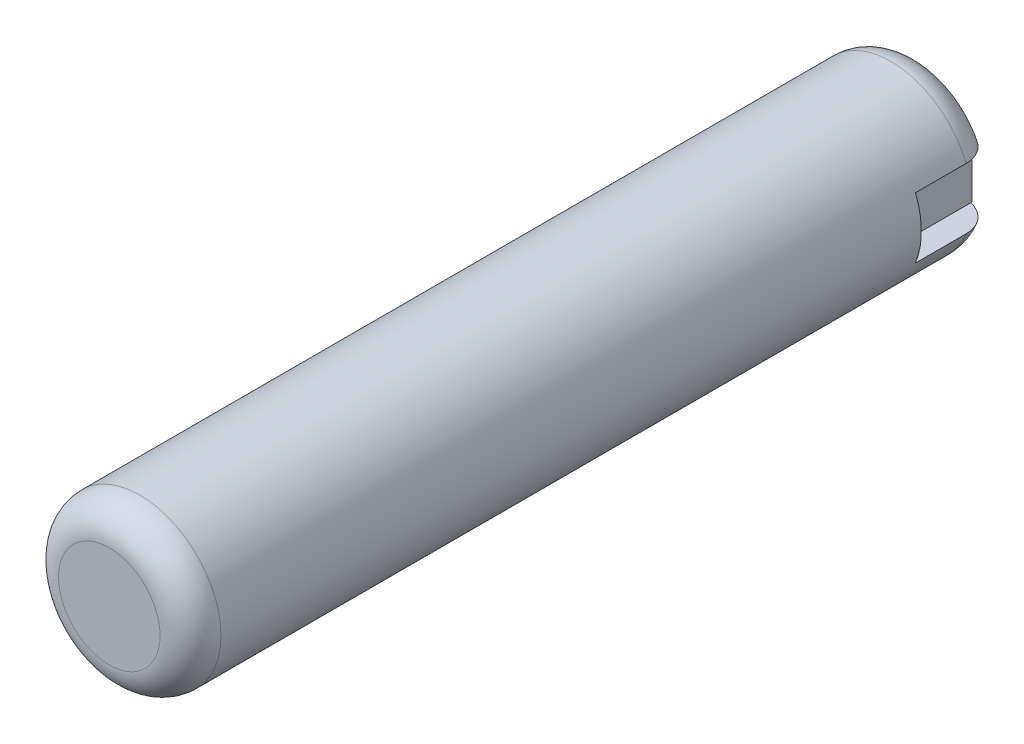
ISO-10303-21;
HEADER;
FILE_DESCRIPTION(('STEP AP214'),'2;1');
FILE_NAME('part.step','',(''),(''),'','','');
FILE_SCHEMA(('AUTOMOTIVE_DESIGN { 1 0 10303 214 1 1 1 1 }'));
ENDSEC;
DATA;
#1=APPLICATION_CONTEXT('core data for automotive mechanical design processes');
#2=APPLICATION_PROTOCOL_DEFINITION('international standard','automotive_design',2000,#1);
#3=PRODUCT_CONTEXT('',#1,'mechanical');
#4=PRODUCT('Part','Part','',(#3));
#5=PRODUCT_RELATED_PRODUCT_CATEGORY('part','',(#4));
#6=PRODUCT_DEFINITION_FORMATION('','',#4);
#7=PRODUCT_DEFINITION_CONTEXT('part definition',#1,'design');
#8=PRODUCT_DEFINITION('design','',#6,#7);
#9=PRODUCT_DEFINITION_SHAPE('','',#8);
#10=(LENGTH_UNIT() NAMED_UNIT(*) SI_UNIT(.MILLI.,.METRE.));
#11=(NAMED_UNIT(*) PLANE_ANGLE_UNIT() SI_UNIT($,.RADIAN.));
#12=(NAMED_UNIT(*) SI_UNIT($,.STERADIAN.) SOLID_ANGLE_UNIT());
#13=UNCERTAINTY_MEASURE_WITH_UNIT(LENGTH_MEASURE(1.E-05),#10,'distance_accuracy_value','');
#14=(GEOMETRIC_REPRESENTATION_CONTEXT(3) GLOBAL_UNCERTAINTY_ASSIGNED_CONTEXT((#13)) GLOBAL_UNIT_ASSIGNED_CONTEXT((#10,
#11,#12)) REPRESENTATION_CONTEXT('',''));
#15=CARTESIAN_POINT('',(0.,0.,0.));
#16=DIRECTION('',(0.,0.,1.));
#17=DIRECTION('',(1.,0.,0.));
#18=AXIS2_PLACEMENT_3D('',#15,#16,#17);
#19=CARTESIAN_POINT('',(0.,0.,-16.));
#20=DIRECTION('',(0.,0.,-1.));
#21=DIRECTION('',(-1.,0.,0.));
#22=AXIS2_PLACEMENT_3D('',#19,#20,#21);
#23=PLANE('',#22);
#24=DIRECTION('',(0.,-1.,0.));
#25=VECTOR('',#24,1.);
#26=CARTESIAN_POINT('',(2.5,1.5,-16.));
#27=LINE('',#26,#25);
#28=CARTESIAN_POINT('',(2.5,1.5,-16.));
#29=VERTEX_POINT('',#28);
#30=CARTESIAN_POINT('',(2.5,-1.5,-16.));
#31=VERTEX_POINT('',#30);
#32=EDGE_CURVE('E93',#29,#31,#27,.T.);
#33=ORIENTED_EDGE('',*,*,#32,.F.);
#34=DIRECTION('',(1.,0.,0.));
#35=VECTOR('',#34,1.);
#36=CARTESIAN_POINT('',(2.5,1.5,-16.));
#37=LINE('',#36,#35);
#38=CARTESIAN_POINT('',(-2.5,1.5,-16.));
#39=VERTEX_POINT('',#38);
#40=EDGE_CURVE('E104',#39,#29,#37,.T.);
#41=ORIENTED_EDGE('',*,*,#40,.F.);
#42=DIRECTION('',(0.,1.,0.));
#43=VECTOR('',#42,1.);
#44=CARTESIAN_POINT('',(-2.5,1.5,-16.));
#45=LINE('',#44,#43);
#46=CARTESIAN_POINT('',(-2.5,-1.5,-16.));
#47=VERTEX_POINT('',#46);
#48=EDGE_CURVE('E95',#47,#39,#45,.T.);
#49=ORIENTED_EDGE('',*,*,#48,.F.);
#50=DIRECTION('',(-1.,0.,0.));
#51=VECTOR('',#50,1.);
#52=CARTESIAN_POINT('',(2.5,-1.5,-16.));
#53=LINE('',#52,#51);
#54=EDGE_CURVE('E85',#31,#47,#53,.T.);
#55=ORIENTED_EDGE('',*,*,#54,.F.);
#56=EDGE_LOOP('',(#33,#41,#49,#55));
#57=FACE_BOUND('',#56,.T.);
#58=ADVANCED_FACE('F43',(#57),#23,.F.);
#59=CARTESIAN_POINT('',(2.5,1.5,-25.8309518948453));
#60=DIRECTION('',(0.,-1.,0.));
#61=DIRECTION('',(0.,0.,-1.));
#62=AXIS2_PLACEMENT_3D('',#59,#60,#61);
#63=PLANE('',#62);
#64=DIRECTION('',(0.,0.,1.));
#65=VECTOR('',#64,1.);
#66=CARTESIAN_POINT('',(2.5,1.5,-25.8309518948453));
#67=LINE('',#66,#65);
#68=CARTESIAN_POINT('',(2.5,1.5,-20.));
#69=VERTEX_POINT('',#68);
#70=EDGE_CURVE('E98',#69,#29,#67,.T.);
#71=ORIENTED_EDGE('',*,*,#70,.F.);
#72=DIRECTION('',(-1.,0.,0.));
#73=VECTOR('',#72,1.);
#74=CARTESIAN_POINT('',(2.5,1.5,-20.));
#75=LINE('',#74,#73);
#76=CARTESIAN_POINT('',(-2.5,1.5,-20.));
#77=VERTEX_POINT('',#76);
#78=EDGE_CURVE('E47',#69,#77,#75,.T.);
#79=ORIENTED_EDGE('',*,*,#78,.T.);
#80=DIRECTION('',(0.,0.,1.));
#81=VECTOR('',#80,1.);
#82=CARTESIAN_POINT('',(-2.5,1.5,-25.8309518948453));
#83=LINE('',#82,#81);
#84=EDGE_CURVE('E107',#77,#39,#83,.T.);
#85=ORIENTED_EDGE('',*,*,#84,.T.);
#86=ORIENTED_EDGE('',*,*,#40,.T.);
#87=EDGE_LOOP('',(#71,#79,#85,#86));
#88=FACE_BOUND('',#87,.T.);
#89=ADVANCED_FACE('F116',(#88),#63,.F.);
#90=CARTESIAN_POINT('',(-2.5,1.5,-25.8309518948453));
#91=DIRECTION('',(1.,0.,0.));
#92=DIRECTION('',(0.,0.,-1.));
#93=AXIS2_PLACEMENT_3D('',#90,#91,#92);
#94=PLANE('',#93);
#95=ORIENTED_EDGE('',*,*,#84,.F.);
#96=DIRECTION('',(0.,-1.,0.));
#97=VECTOR('',#96,1.);
#98=CARTESIAN_POINT('',(-2.5,1.5,-20.));
#99=LINE('',#98,#97);
#100=CARTESIAN_POINT('',(-2.5,-1.5,-20.));
#101=VERTEX_POINT('',#100);
#102=EDGE_CURVE('E113',#77,#101,#99,.T.);
#103=ORIENTED_EDGE('',*,*,#102,.T.);
#104=DIRECTION('',(0.,0.,1.));
#105=VECTOR('',#104,1.);
#106=CARTESIAN_POINT('',(-2.5,-1.5,-25.8309518948453));
#107=LINE('',#106,#105);
#108=EDGE_CURVE('E89',#101,#47,#107,.T.);
#109=ORIENTED_EDGE('',*,*,#108,.T.);
#110=ORIENTED_EDGE('',*,*,#48,.T.);
#111=EDGE_LOOP('',(#95,#103,#109,#110));
#112=FACE_BOUND('',#111,.T.);
#113=ADVANCED_FACE('F112',(#112),#94,.F.);
#114=CARTESIAN_POINT('',(2.5,-1.5,-25.8309518948453));
#115=DIRECTION('',(0.,1.,0.));
#116=DIRECTION('',(0.,0.,1.));
#117=AXIS2_PLACEMENT_3D('',#114,#115,#116);
#118=PLANE('',#117);
#119=ORIENTED_EDGE('',*,*,#108,.F.);
#120=DIRECTION('',(1.,0.,0.));
#121=VECTOR('',#120,1.);
#122=CARTESIAN_POINT('',(2.5,-1.5,-20.));
#123=LINE('',#122,#121);
#124=CARTESIAN_POINT('',(2.5,-1.5,-20.));
#125=VERTEX_POINT('',#124);
#126=EDGE_CURVE('E52',#101,#125,#123,.T.);
#127=ORIENTED_EDGE('',*,*,#126,.T.);
#128=DIRECTION('',(0.,0.,1.));
#129=VECTOR('',#128,1.);
#130=CARTESIAN_POINT('',(2.5,-1.5,-25.8309518948453));
#131=LINE('',#130,#129);
#132=EDGE_CURVE('E82',#125,#31,#131,.T.);
#133=ORIENTED_EDGE('',*,*,#132,.T.);
#134=ORIENTED_EDGE('',*,*,#54,.T.);
#135=EDGE_LOOP('',(#119,#127,#133,#134));
#136=FACE_BOUND('',#135,.T.);
#137=ADVANCED_FACE('F84',(#136),#118,.F.);
#138=CARTESIAN_POINT('',(2.5,1.5,-25.8309518948453));
#139=DIRECTION('',(-1.,0.,0.));
#140=DIRECTION('',(0.,-1.,0.));
#141=AXIS2_PLACEMENT_3D('',#138,#139,#140);
#142=PLANE('',#141);
#143=ORIENTED_EDGE('',*,*,#132,.F.);
#144=DIRECTION('',(0.,1.,0.));
#145=VECTOR('',#144,1.);
#146=CARTESIAN_POINT('',(2.5,1.5,-20.));
#147=LINE('',#146,#145);
#148=EDGE_CURVE('E12',#125,#69,#147,.T.);
#149=ORIENTED_EDGE('',*,*,#148,.T.);
#150=ORIENTED_EDGE('',*,*,#70,.T.);
#151=ORIENTED_EDGE('',*,*,#32,.T.);
#152=EDGE_LOOP('',(#143,#149,#150,#151));
#153=FACE_BOUND('',#152,.T.);
#154=ADVANCED_FACE('F45',(#153),#142,.F.);
#155=CARTESIAN_POINT('',(0.,0.,-20.));
#156=DIRECTION('',(0.,0.,1.));
#157=DIRECTION('',(1.,0.,0.));
#158=AXIS2_PLACEMENT_3D('',#155,#156,#157);
#159=PLANE('',#158);
#160=ORIENTED_EDGE('',*,*,#126,.F.);
#161=ORIENTED_EDGE('',*,*,#102,.F.);
#162=ORIENTED_EDGE('',*,*,#78,.F.);
#163=ORIENTED_EDGE('',*,*,#148,.F.);
#164=EDGE_LOOP('',(#160,#161,#162,#163));
#165=FACE_BOUND('',#164,.T.);
#166=ADVANCED_FACE('F130',(#165),#159,.F.);
#167=CLOSED_SHELL('',(#58,#89,#113,#137,#154,#166));
#168=MANIFOLD_SOLID_BREP('B2',#167);
#169=CARTESIAN_POINT('',(0.,0.,-20.));
#170=DIRECTION('',(0.,0.,1.));
#171=DIRECTION('',(1.,0.,0.));
#172=AXIS2_PLACEMENT_3D('',#169,#170,#171);
#173=PLANE('',#172);
#174=CARTESIAN_POINT('',(0.,0.,-20.));
#175=DIRECTION('',(0.,0.,1.));
#176=DIRECTION('',(1.,0.,0.));
#177=AXIS2_PLACEMENT_3D('',#174,#175,#176);
#178=CIRCLE('',#177,2.5);
#179=CARTESIAN_POINT('',(2.,-1.5,-20.));
#180=VERTEX_POINT('',#179);
#181=CARTESIAN_POINT('',(-1.99999999999999,-1.5,-20.));
#182=VERTEX_POINT('',#181);
#183=EDGE_CURVE('E236',#180,#182,#178,.F.);
#184=ORIENTED_EDGE('',*,*,#183,.T.);
#185=DIRECTION('',(1.,0.,0.));
#186=VECTOR('',#185,1.);
#187=CARTESIAN_POINT('',(-5.,-1.5,-20.));
#188=LINE('',#187,#186);
#189=EDGE_CURVE('E282',#182,#180,#188,.T.);
#190=ORIENTED_EDGE('',*,*,#189,.T.);
#191=EDGE_LOOP('',(#184,#190));
#192=FACE_BOUND('',#191,.T.);
#193=ADVANCED_FACE('F166',(#192),#173,.F.);
#194=CARTESIAN_POINT('',(0.,0.,-18.5));
#195=DIRECTION('',(0.,0.,1.));
#196=DIRECTION('',(1.,0.,0.));
#197=AXIS2_PLACEMENT_3D('',#194,#195,#196);
#198=TOROIDAL_SURFACE('',#197,2.5,1.5);
#199=CARTESIAN_POINT('',(0.,-1.5,-19.6180339887505));
#200=CARTESIAN_POINT('',(-0.067443218359986,-1.5,-19.6180389023118));
#201=CARTESIAN_POINT('',(-0.134891214664913,-1.5,-19.622194788994));
#202=CARTESIAN_POINT('',(-0.269113503832246,-1.5,-19.6378031521689));
#203=CARTESIAN_POINT('',(-0.335884506737289,-1.5,-19.6492817829432));
#204=CARTESIAN_POINT('',(-0.469702157328218,-1.5,-19.6774798642178));
#205=CARTESIAN_POINT('',(-0.536725433197593,-1.5,-19.6943037705338));
#206=CARTESIAN_POINT('',(-0.669981653953298,-1.5,-19.7305294834033));
#207=CARTESIAN_POINT('',(-0.736215176381459,-1.5,-19.7499292618913));
#208=CARTESIAN_POINT('',(-0.887458542690038,-1.5,-19.7948115372455));
#209=CARTESIAN_POINT('',(-0.972421877741422,-1.5,-19.8204471560161));
#210=CARTESIAN_POINT('',(-1.14314540221406,-1.5,-19.8690762139822));
#211=CARTESIAN_POINT('',(-1.22890570078372,-1.5,-19.8920692853262));
#212=CARTESIAN_POINT('',(-1.40069061196947,-1.5,-19.9325638404054));
#213=CARTESIAN_POINT('',(-1.48670001575131,-1.5,-19.9501272439693));
#214=CARTESIAN_POINT('',(-1.65986180086239,-1.5,-19.9780561528693));
#215=CARTESIAN_POINT('',(-1.74701344625855,-1.5,-19.9884260809764));
#216=CARTESIAN_POINT('',(-1.94596765287344,-1.5,-20.0018483978144));
#217=CARTESIAN_POINT('',(-2.05799071916539,-1.5,-20.0021224023447));
#218=CARTESIAN_POINT('',(-2.28124658847306,-1.5,-19.9852175644564));
#219=CARTESIAN_POINT('',(-2.39247516164495,-1.5,-19.9679766219299));
#220=CARTESIAN_POINT('',(-2.61120058918486,-1.5,-19.9137365826692));
#221=CARTESIAN_POINT('',(-2.71865555781505,-1.5,-19.8765634707244));
#222=CARTESIAN_POINT('',(-2.92401702575213,-1.5,-19.7816755911863));
#223=CARTESIAN_POINT('',(-3.0219412509115,-1.5,-19.7239999228368));
#224=CARTESIAN_POINT('',(-3.19032422177093,-1.5,-19.5987398165864));
#225=CARTESIAN_POINT('',(-3.26270827387416,-1.5,-19.5337414943054));
#226=CARTESIAN_POINT('',(-3.39363829174985,-1.5,-19.3910075327643));
#227=CARTESIAN_POINT('',(-3.45219226507034,-1.5,-19.3132793084239));
#228=CARTESIAN_POINT('',(-3.5464620418693,-1.5,-19.1578881198251));
#229=CARTESIAN_POINT('',(-3.58409723058932,-1.5,-19.0813844311611));
#230=CARTESIAN_POINT('',(-3.64505238801619,-1.5,-18.922881222557));
#231=CARTESIAN_POINT('',(-3.66837988574422,-1.5,-18.8408846183519));
#232=CARTESIAN_POINT('',(-3.69883241569647,-1.5,-18.6790248469315));
#233=CARTESIAN_POINT('',(-3.70684237749878,-1.5,-18.5993270043688));
#234=CARTESIAN_POINT('',(-3.7090816765802,-1.5,-18.4397417893482));
#235=CARTESIAN_POINT('',(-3.70331306457525,-1.5,-18.3598544468622));
#236=CARTESIAN_POINT('',(-3.67845493266942,-1.5,-18.2037639384382));
#237=CARTESIAN_POINT('',(-3.65962296399182,-1.5,-18.1275195013601));
#238=CARTESIAN_POINT('',(-3.60958299760921,-1.5,-17.9792171411024));
#239=CARTESIAN_POINT('',(-3.57837502848104,-1.5,-17.9071592082564));
#240=CARTESIAN_POINT('',(-3.50417305903596,-1.5,-17.768201729966));
#241=CARTESIAN_POINT('',(-3.46103169439424,-1.5,-17.7013810500179));
#242=CARTESIAN_POINT('',(-3.36458974499622,-1.5,-17.5755416136847));
#243=CARTESIAN_POINT('',(-3.31128753031318,-1.5,-17.5165241116022));
#244=CARTESIAN_POINT('',(-3.19360012134622,-1.5,-17.4050306746391));
#245=CARTESIAN_POINT('',(-3.12882472403076,-1.5,-17.3529675019128));
#246=CARTESIAN_POINT('',(-2.99202764598746,-1.5,-17.2595055940013));
#247=CARTESIAN_POINT('',(-2.9200051430539,-1.5,-17.2181080707671));
#248=CARTESIAN_POINT('',(-2.76452070601886,-1.5,-17.143323237907));
#249=CARTESIAN_POINT('',(-2.68060536202213,-1.5,-17.1108829963544));
#250=CARTESIAN_POINT('',(-2.50888581689852,-1.5,-17.0586572350327));
#251=CARTESIAN_POINT('',(-2.42107790327944,-1.5,-17.0388840866017));
#252=CARTESIAN_POINT('',(-2.26794192513112,-1.5,-17.0150304282208));
#253=CARTESIAN_POINT('',(-2.20302623381469,-1.5,-17.0081385147953));
#254=CARTESIAN_POINT('',(-2.0728187465825,-1.5,-17.0001834197843));
#255=CARTESIAN_POINT('',(-2.0075268147217,-1.5,-16.9991224970079));
#256=CARTESIAN_POINT('',(-1.87716387430802,-1.5,-17.002281141673));
#257=CARTESIAN_POINT('',(-1.81209269907248,-1.5,-17.0064947138274));
#258=CARTESIAN_POINT('',(-1.68241124854157,-1.5,-17.0195434177241));
#259=CARTESIAN_POINT('',(-1.61780111520115,-1.5,-17.0283799154812));
#260=CARTESIAN_POINT('',(-1.48722173464179,-1.5,-17.0502757621363));
#261=CARTESIAN_POINT('',(-1.42127381210264,-1.5,-17.0634593998186));
#262=CARTESIAN_POINT('',(-1.29011482422925,-1.5,-17.0930360074684));
#263=CARTESIAN_POINT('',(-1.22490379809051,-1.5,-17.1094291473072));
#264=CARTESIAN_POINT('',(-1.09462375239087,-1.5,-17.1444760339784));
#265=CARTESIAN_POINT('',(-1.02955880708644,-1.5,-17.1631445784241));
#266=CARTESIAN_POINT('',(-0.899683492892818,-1.5,-17.2013473018588));
#267=CARTESIAN_POINT('',(-0.834873151045946,-1.5,-17.2208815702303));
#268=CARTESIAN_POINT('',(-0.704302786086257,-1.5,-17.2594006129253));
#269=CARTESIAN_POINT('',(-0.638540185118781,-1.5,-17.2783769248361));
#270=CARTESIAN_POINT('',(-0.50619206538531,-1.5,-17.3134249456873));
#271=CARTESIAN_POINT('',(-0.439606365251178,-1.5,-17.3294960018172));
#272=CARTESIAN_POINT('',(-0.306399823396888,-1.5,-17.3559621846303));
#273=CARTESIAN_POINT('',(-0.239797959251787,-1.5,-17.3664472081624));
#274=CARTESIAN_POINT('',(-0.105897322625608,-1.5,-17.3798861769023));
#275=CARTESIAN_POINT('',(-0.0386001153917617,-1.5,-17.3828543987382));
#276=CARTESIAN_POINT('',(0.0710202725195837,-1.5,-17.381007535528));
#277=CARTESIAN_POINT('',(0.113400159589978,-1.5,-17.3786593044328));
#278=CARTESIAN_POINT('',(0.197892956878934,-1.5,-17.3709696449963));
#279=CARTESIAN_POINT('',(0.240005805238093,-1.5,-17.3656275470277));
#280=CARTESIAN_POINT('',(0.365954446881726,-1.5,-17.3457711252637));
#281=CARTESIAN_POINT('',(0.449168774898607,-1.5,-17.3274350239503));
#282=CARTESIAN_POINT('',(0.615981566159804,-1.5,-17.2850448311915));
#283=CARTESIAN_POINT('',(0.699546349630877,-1.5,-17.2608710833537));
#284=CARTESIAN_POINT('',(0.866270358430299,-1.5,-17.2115412072055));
#285=CARTESIAN_POINT('',(0.949429949398501,-1.5,-17.1863862890314));
#286=CARTESIAN_POINT('',(1.11499313591273,-1.5,-17.1387360563503));
#287=CARTESIAN_POINT('',(1.19738532389999,-1.5,-17.1162026023356));
#288=CARTESIAN_POINT('',(1.36335166827282,-1.5,-17.0756907211771));
#289=CARTESIAN_POINT('',(1.44692620721484,-1.5,-17.0577138056423));
#290=CARTESIAN_POINT('',(1.61428262207525,-1.5,-17.0284562579554));
#291=CARTESIAN_POINT('',(1.69805074073002,-1.5,-17.0171000573462));
#292=CARTESIAN_POINT('',(1.86625575155661,-1.5,-17.0023676834065));
#293=CARTESIAN_POINT('',(1.95069209382356,-1.5,-16.9989855193651));
#294=CARTESIAN_POINT('',(2.13756211285442,-1.5,-17.0018170375209));
#295=CARTESIAN_POINT('',(2.23998324920608,-1.5,-17.0102373680036));
#296=CARTESIAN_POINT('',(2.44266200874023,-1.5,-17.0427247494891));
#297=CARTESIAN_POINT('',(2.54291374472248,-1.5,-17.0668299192976));
#298=CARTESIAN_POINT('',(2.73857249873277,-1.5,-17.1320248639572));
#299=CARTESIAN_POINT('',(2.83394327073782,-1.5,-17.1732254274918));
#300=CARTESIAN_POINT('',(3.01532355236738,-1.5,-17.272684750428));
#301=CARTESIAN_POINT('',(3.10134300444061,-1.5,-17.3309251446858));
#302=CARTESIAN_POINT('',(3.2529174327246,-1.5,-17.4572978266517));
#303=CARTESIAN_POINT('',(3.31962194065803,-1.5,-17.5240494009715));
#304=CARTESIAN_POINT('',(3.43924074538915,-1.5,-17.6689625716257));
#305=CARTESIAN_POINT('',(3.49216210710739,-1.5,-17.7471182902787));
#306=CARTESIAN_POINT('',(3.57700008231161,-1.5,-17.9034537161116));
#307=CARTESIAN_POINT('',(3.61054991809454,-1.5,-17.9807504416912));
#308=CARTESIAN_POINT('',(3.66336753531404,-1.5,-18.1400718401412));
#309=CARTESIAN_POINT('',(3.68264154012591,-1.5,-18.2220944359984));
#310=CARTESIAN_POINT('',(3.70551215421035,-1.5,-18.3838351941047));
#311=CARTESIAN_POINT('',(3.70988744245734,-1.5,-18.4634441893041));
#312=CARTESIAN_POINT('',(3.70499091361936,-1.5,-18.6222364819615));
#313=CARTESIAN_POINT('',(3.69572083978709,-1.5,-18.7014198325003));
#314=CARTESIAN_POINT('',(3.66411345503666,-1.5,-18.8559054541186));
#315=CARTESIAN_POINT('',(3.6419706734123,-1.5,-18.9312477172134));
#316=CARTESIAN_POINT('',(3.5855542254629,-1.5,-19.0772320472724));
#317=CARTESIAN_POINT('',(3.55128046547563,-1.5,-19.1478740779415));
#318=CARTESIAN_POINT('',(3.47108495641519,-1.5,-19.2838165801425));
#319=CARTESIAN_POINT('',(3.42497520673484,-1.5,-19.3490059109339));
#320=CARTESIAN_POINT('',(3.32293884061514,-1.5,-19.4711667002785));
#321=CARTESIAN_POINT('',(3.26701055206731,-1.5,-19.5281367560643));
#322=CARTESIAN_POINT('',(3.14410162129748,-1.5,-19.6353499837493));
#323=CARTESIAN_POINT('',(3.07671225536459,-1.5,-19.685123554533));
#324=CARTESIAN_POINT('',(2.9350963078845,-1.5,-19.7737048009848));
#325=CARTESIAN_POINT('',(2.86086756636864,-1.5,-19.8125089965256));
#326=CARTESIAN_POINT('',(2.70074627201693,-1.5,-19.8819135607371));
#327=CARTESIAN_POINT('',(2.61440412801981,-1.5,-19.9114714018745));
#328=CARTESIAN_POINT('',(2.43841828727688,-1.5,-19.9576890170999));
#329=CARTESIAN_POINT('',(2.34877559154693,-1.5,-19.9743526686228));
#330=CARTESIAN_POINT('',(2.19096528375751,-1.5,-19.9930550712498));
#331=CARTESIAN_POINT('',(2.12308619712597,-1.5,-19.9977230747823));
#332=CARTESIAN_POINT('',(1.98713700391296,-1.5,-20.0009680666922));
#333=CARTESIAN_POINT('',(1.91906678810649,-1.5,-19.9995401902314));
#334=CARTESIAN_POINT('',(1.78278793677329,-1.5,-19.9912291630337));
#335=CARTESIAN_POINT('',(1.71458185630841,-1.5,-19.9843066606693));
#336=CARTESIAN_POINT('',(1.57892112060137,-1.5,-19.9657766854278));
#337=CARTESIAN_POINT('',(1.51146557676163,-1.5,-19.9541755372703));
#338=CARTESIAN_POINT('',(1.38307646237632,-1.5,-19.9283609516377));
#339=CARTESIAN_POINT('',(1.32207917064422,-1.5,-19.9144563958446));
#340=CARTESIAN_POINT('',(1.2006667277097,-1.5,-19.8842945208345));
#341=CARTESIAN_POINT('',(1.14025169496023,-1.5,-19.8680367332274));
#342=CARTESIAN_POINT('',(1.01954030229033,-1.5,-19.8340172125581));
#343=CARTESIAN_POINT('',(0.959245927200385,-1.5,-19.8162485904508));
#344=CARTESIAN_POINT('',(0.838747749648913,-1.5,-19.7804053896165));
#345=CARTESIAN_POINT('',(0.778543951068366,-1.5,-19.7623307981644));
#346=CARTESIAN_POINT('',(0.659367085216409,-1.5,-19.7277287044211));
#347=CARTESIAN_POINT('',(0.600402357567929,-1.5,-19.711173312366));
#348=CARTESIAN_POINT('',(0.481766706311097,-1.5,-19.680699657139));
#349=CARTESIAN_POINT('',(0.422095765950292,-1.5,-19.6667814566592));
#350=CARTESIAN_POINT('',(0.302324012484656,-1.5,-19.6435138748681));
#351=CARTESIAN_POINT('',(0.242230560862114,-1.5,-19.6341285098232));
#352=CARTESIAN_POINT('',(0.121425607500747,-1.5,-19.6213891857022));
#353=CARTESIAN_POINT('',(0.0607147398283687,-1.5,-19.6180295653912));
#354=CARTESIAN_POINT('',(0.,-1.5,-19.6180339887505));
#355=B_SPLINE_CURVE_WITH_KNOTS('',3,(#199,#200,#201,#202,#203,#204,#205,#206,#207,#208,#209,
#210,#211,#212,#213,#214,#215,#216,#217,#218,#219,#220,#221,#222,#223,#224,#225,#226,#227,#228,
#229,#230,#231,#232,#233,#234,#235,#236,#237,#238,#239,#240,#241,#242,#243,#244,#245,#246,#247,
#248,#249,#250,#251,#252,#253,#254,#255,#256,#257,#258,#259,#260,#261,#262,#263,#264,#265,#266,
#267,#268,#269,#270,#271,#272,#273,#274,#275,#276,#277,#278,#279,#280,#281,#282,#283,#284,#285,
#286,#287,#288,#289,#290,#291,#292,#293,#294,#295,#296,#297,#298,#299,#300,#301,#302,#303,#304,
#305,#306,#307,#308,#309,#310,#311,#312,#313,#314,#315,#316,#317,#318,#319,#320,#321,#322,#323,
#324,#325,#326,#327,#328,#329,#330,#331,#332,#333,#334,#335,#336,#337,#338,#339,#340,#341,#342,
#343,#344,#345,#346,#347,#348,#349,#350,#351,#352,#353,#354),.UNSPECIFIED.,.T.,.F.,(4,2,2,2,2,2,
2,2,2,2,2,2,2,2,2,2,2,2,2,2,2,2,2,2,2,2,2,2,2,2,2,2,2,2,2,2,2,2,2,2,2,2,2,2,2,2,2,2,2,2,2,2,2,2,
2,2,2,2,2,2,2,2,2,2,2,2,2,2,2,2,2,2,2,2,2,2,2,4),(0.,0.202235477752828,0.405197345051835,
0.612398415454491,0.819437306700421,1.08567739580457,1.35195450165481,1.61507227996098,
1.87802814159871,2.2129296202395,2.54902266701702,2.88809887798791,3.22653189497312,
3.51670045782654,3.80670060038387,4.06116257444919,4.31549052989386,4.55462024973701,
4.79371438124007,5.02822385085906,5.2627327789866,5.50027793284758,5.73786122402063,
5.98611332739134,6.23439362752709,6.50323166329347,6.77233186150439,6.96791346496745,
7.16357082749155,7.35900599667672,7.5544989470811,7.75615189782565,7.95781552447381,
8.16086863808342,8.36394276516424,8.56926196235497,8.77462723754269,8.97657925720465,
9.17814742163916,9.30537406038517,9.43262916681401,9.6878289832525,9.94878562538097,
10.2094300050838,10.4656150718366,10.721885015804,10.9751695526014,11.2282637418139,
11.5354799239981,11.8434455352902,12.1534389211438,12.4630994262105,12.7446070897836,
13.0259701738158,13.277470114906,13.5288603530147,13.7668915430853,14.004892326304,
14.2393866883062,14.4738828608584,14.7123630057157,14.9508838034841,15.2011540248573,
15.4515035576981,15.7242172784344,15.9968489590351,16.2006904200868,16.4046945879235,
16.610173129076,16.8153748249214,17.0029994796661,17.1906615309412,17.3792305841781,
17.5678074992761,17.7515172773148,17.9352314220022,18.1174621568503,18.2995215946175),.UNSPECIFIED.);
#356=CARTESIAN_POINT('',(-3.70809924354783,-1.5,-18.5));
#357=VERTEX_POINT('',#356);
#358=EDGE_CURVE('E189',#182,#357,#355,.T.);
#359=ORIENTED_EDGE('',*,*,#358,.F.);
#360=ORIENTED_EDGE('',*,*,#183,.F.);
#361=CARTESIAN_POINT('',(3.70809924354783,-1.5,-18.5));
#362=VERTEX_POINT('',#361);
#363=EDGE_CURVE('E248',#362,#180,#355,.T.);
#364=ORIENTED_EDGE('',*,*,#363,.F.);
#365=CARTESIAN_POINT('',(0.,0.,-18.5));
#366=DIRECTION('',(0.,0.,1.));
#367=DIRECTION('',(1.,0.,0.));
#368=AXIS2_PLACEMENT_3D('',#365,#366,#367);
#369=CIRCLE('',#368,4.);
#370=EDGE_CURVE('E240',#357,#362,#369,.T.);
#371=ORIENTED_EDGE('',*,*,#370,.F.);
#372=EDGE_LOOP('',(#359,#360,#364,#371));
#373=FACE_BOUND('',#372,.T.);
#374=ADVANCED_FACE('F267',(#373),#198,.T.);
#375=CARTESIAN_POINT('',(0.,0.,20.));
#376=DIRECTION('',(0.,0.,-1.));
#377=DIRECTION('',(-1.,0.,0.));
#378=AXIS2_PLACEMENT_3D('',#375,#376,#377);
#379=CYLINDRICAL_SURFACE('',#378,4.);
#380=ORIENTED_EDGE('',*,*,#370,.T.);
#381=DIRECTION('',(0.,0.,-1.));
#382=VECTOR('',#381,1.);
#383=CARTESIAN_POINT('',(3.70809924354783,-1.50000000000001,20.));
#384=LINE('',#383,#382);
#385=CARTESIAN_POINT('',(3.70809924354783,-1.5,-16.));
#386=VERTEX_POINT('',#385);
#387=EDGE_CURVE('E290',#362,#386,#384,.F.);
#388=ORIENTED_EDGE('',*,*,#387,.T.);
#389=CARTESIAN_POINT('',(0.,0.,-16.));
#390=DIRECTION('',(0.,0.,1.));
#391=DIRECTION('',(1.,0.,0.));
#392=AXIS2_PLACEMENT_3D('',#389,#390,#391);
#393=CIRCLE('',#392,4.);
#394=CARTESIAN_POINT('',(3.70809924354783,1.5,-16.));
#395=VERTEX_POINT('',#394);
#396=EDGE_CURVE('E41',#386,#395,#393,.T.);
#397=ORIENTED_EDGE('',*,*,#396,.T.);
#398=DIRECTION('',(0.,0.,-1.));
#399=VECTOR('',#398,1.);
#400=CARTESIAN_POINT('',(3.70809924354783,1.50000000000001,20.));
#401=LINE('',#400,#399);
#402=CARTESIAN_POINT('',(3.70809924354783,1.5,-18.5));
#403=VERTEX_POINT('',#402);
#404=EDGE_CURVE('E287',#395,#403,#401,.T.);
#405=ORIENTED_EDGE('',*,*,#404,.T.);
#406=CARTESIAN_POINT('',(-3.70809924354783,1.5,-18.5));
#407=VERTEX_POINT('',#406);
#408=EDGE_CURVE('E237',#403,#407,#369,.T.);
#409=ORIENTED_EDGE('',*,*,#408,.T.);
#410=DIRECTION('',(0.,0.,-1.));
#411=VECTOR('',#410,1.);
#412=CARTESIAN_POINT('',(-3.70809924354783,1.50000000000001,20.));
#413=LINE('',#412,#411);
#414=CARTESIAN_POINT('',(-3.70809924354783,1.5,-16.));
#415=VERTEX_POINT('',#414);
#416=EDGE_CURVE('E181',#407,#415,#413,.F.);
#417=ORIENTED_EDGE('',*,*,#416,.T.);
#418=CARTESIAN_POINT('',(-3.70809924354783,-1.5,-16.));
#419=VERTEX_POINT('',#418);
#420=EDGE_CURVE('E170',#415,#419,#393,.T.);
#421=ORIENTED_EDGE('',*,*,#420,.T.);
#422=DIRECTION('',(0.,0.,-1.));
#423=VECTOR('',#422,1.);
#424=CARTESIAN_POINT('',(-3.70809924354783,-1.50000000000001,20.));
#425=LINE('',#424,#423);
#426=EDGE_CURVE('E292',#419,#357,#425,.T.);
#427=ORIENTED_EDGE('',*,*,#426,.T.);
#428=EDGE_LOOP('',(#380,#388,#397,#405,#409,#417,#421,#427));
#429=FACE_BOUND('',#428,.T.);
#430=CARTESIAN_POINT('',(0.,0.,18.5));
#431=DIRECTION('',(0.,0.,1.));
#432=DIRECTION('',(1.,0.,0.));
#433=AXIS2_PLACEMENT_3D('',#430,#431,#432);
#434=CIRCLE('',#433,4.);
#435=CARTESIAN_POINT('',(4.,0.,18.5));
#436=VERTEX_POINT('',#435);
#437=EDGE_CURVE('E296',#436,#436,#434,.F.);
#438=ORIENTED_EDGE('',*,*,#437,.T.);
#439=EDGE_LOOP('',(#438));
#440=FACE_BOUND('',#439,.T.);
#441=ADVANCED_FACE('F263',(#429,#440),#379,.T.);
#442=CARTESIAN_POINT('',(0.,0.,20.));
#443=DIRECTION('',(0.,0.,1.));
#444=DIRECTION('',(1.,0.,0.));
#445=AXIS2_PLACEMENT_3D('',#442,#443,#444);
#446=PLANE('',#445);
#447=CARTESIAN_POINT('',(0.,0.,20.));
#448=DIRECTION('',(0.,0.,1.));
#449=DIRECTION('',(1.,0.,0.));
#450=AXIS2_PLACEMENT_3D('',#447,#448,#449);
#451=CIRCLE('',#450,2.5);
#452=CARTESIAN_POINT('',(2.5,0.,20.));
#453=VERTEX_POINT('',#452);
#454=EDGE_CURVE('E227',#453,#453,#451,.T.);
#455=ORIENTED_EDGE('',*,*,#454,.T.);
#456=EDGE_LOOP('',(#455));
#457=FACE_BOUND('',#456,.T.);
#458=ADVANCED_FACE('F260',(#457),#446,.T.);
#459=CARTESIAN_POINT('',(-2.,1.5,-20.));
#460=VERTEX_POINT('',#459);
#461=CARTESIAN_POINT('',(1.99999999999999,1.5,-20.));
#462=VERTEX_POINT('',#461);
#463=EDGE_CURVE('E232',#460,#462,#178,.F.);
#464=ORIENTED_EDGE('',*,*,#463,.T.);
#465=DIRECTION('',(1.,0.,0.));
#466=VECTOR('',#465,1.);
#467=CARTESIAN_POINT('',(-5.,1.5,-20.));
#468=LINE('',#467,#466);
#469=EDGE_CURVE('E220',#460,#462,#468,.T.);
#470=ORIENTED_EDGE('',*,*,#469,.F.);
#471=EDGE_LOOP('',(#464,#470));
#472=FACE_BOUND('',#471,.T.);
#473=ADVANCED_FACE('F231',(#472),#173,.F.);
#474=CARTESIAN_POINT('',(0.,1.5,-19.6180339887505));
#475=CARTESIAN_POINT('',(0.067443218359986,1.5,-19.6180389023118));
#476=CARTESIAN_POINT('',(0.134891214664913,1.5,-19.622194788994));
#477=CARTESIAN_POINT('',(0.269113503832246,1.5,-19.6378031521689));
#478=CARTESIAN_POINT('',(0.335884506737289,1.5,-19.6492817829432));
#479=CARTESIAN_POINT('',(0.469702157328218,1.5,-19.6774798642178));
#480=CARTESIAN_POINT('',(0.536725433197593,1.5,-19.6943037705338));
#481=CARTESIAN_POINT('',(0.669981653953298,1.5,-19.7305294834033));
#482=CARTESIAN_POINT('',(0.736215176381459,1.5,-19.7499292618913));
#483=CARTESIAN_POINT('',(0.887458542690038,1.5,-19.7948115372455));
#484=CARTESIAN_POINT('',(0.972421877741422,1.5,-19.8204471560161));
#485=CARTESIAN_POINT('',(1.14314540221406,1.5,-19.8690762139822));
#486=CARTESIAN_POINT('',(1.22890570078372,1.5,-19.8920692853262));
#487=CARTESIAN_POINT('',(1.40069061196947,1.5,-19.9325638404054));
#488=CARTESIAN_POINT('',(1.48670001575131,1.5,-19.9501272439693));
#489=CARTESIAN_POINT('',(1.65986180086239,1.5,-19.9780561528693));
#490=CARTESIAN_POINT('',(1.74701344625855,1.5,-19.9884260809764));
#491=CARTESIAN_POINT('',(1.94596765287344,1.5,-20.0018483978144));
#492=CARTESIAN_POINT('',(2.05799071916539,1.5,-20.0021224023447));
#493=CARTESIAN_POINT('',(2.28124658847306,1.5,-19.9852175644564));
#494=CARTESIAN_POINT('',(2.39247516164495,1.5,-19.9679766219299));
#495=CARTESIAN_POINT('',(2.61120058918486,1.5,-19.9137365826692));
#496=CARTESIAN_POINT('',(2.71865555781505,1.5,-19.8765634707244));
#497=CARTESIAN_POINT('',(2.92401702575213,1.5,-19.7816755911863));
#498=CARTESIAN_POINT('',(3.0219412509115,1.5,-19.7239999228368));
#499=CARTESIAN_POINT('',(3.19032422177093,1.5,-19.5987398165864));
#500=CARTESIAN_POINT('',(3.26270827387416,1.5,-19.5337414943054));
#501=CARTESIAN_POINT('',(3.39363829174985,1.5,-19.3910075327643));
#502=CARTESIAN_POINT('',(3.45219226507034,1.5,-19.3132793084239));
#503=CARTESIAN_POINT('',(3.5464620418693,1.5,-19.1578881198251));
#504=CARTESIAN_POINT('',(3.58409723058932,1.5,-19.0813844311611));
#505=CARTESIAN_POINT('',(3.64505238801619,1.5,-18.922881222557));
#506=CARTESIAN_POINT('',(3.66837988574422,1.5,-18.8408846183519));
#507=CARTESIAN_POINT('',(3.69883241569647,1.5,-18.6790248469315));
#508=CARTESIAN_POINT('',(3.70684237749878,1.5,-18.5993270043688));
#509=CARTESIAN_POINT('',(3.7090816765802,1.5,-18.4397417893482));
#510=CARTESIAN_POINT('',(3.70331306457525,1.5,-18.3598544468622));
#511=CARTESIAN_POINT('',(3.67845493266942,1.5,-18.2037639384382));
#512=CARTESIAN_POINT('',(3.65962296399182,1.5,-18.1275195013601));
#513=CARTESIAN_POINT('',(3.60958299760921,1.5,-17.9792171411024));
#514=CARTESIAN_POINT('',(3.57837502848104,1.5,-17.9071592082564));
#515=CARTESIAN_POINT('',(3.50417305903596,1.5,-17.768201729966));
#516=CARTESIAN_POINT('',(3.46103169439424,1.5,-17.7013810500179));
#517=CARTESIAN_POINT('',(3.36458974499622,1.5,-17.5755416136847));
#518=CARTESIAN_POINT('',(3.31128753031318,1.5,-17.5165241116022));
#519=CARTESIAN_POINT('',(3.19360012134622,1.5,-17.4050306746391));
#520=CARTESIAN_POINT('',(3.12882472403076,1.5,-17.3529675019128));
#521=CARTESIAN_POINT('',(2.99202764598746,1.5,-17.2595055940013));
#522=CARTESIAN_POINT('',(2.9200051430539,1.5,-17.2181080707671));
#523=CARTESIAN_POINT('',(2.76452070601886,1.5,-17.143323237907));
#524=CARTESIAN_POINT('',(2.68060536202213,1.5,-17.1108829963544));
#525=CARTESIAN_POINT('',(2.50888581689852,1.5,-17.0586572350327));
#526=CARTESIAN_POINT('',(2.42107790327944,1.5,-17.0388840866017));
#527=CARTESIAN_POINT('',(2.26794192513112,1.5,-17.0150304282208));
#528=CARTESIAN_POINT('',(2.20302623381469,1.5,-17.0081385147953));
#529=CARTESIAN_POINT('',(2.0728187465825,1.5,-17.0001834197843));
#530=CARTESIAN_POINT('',(2.0075268147217,1.5,-16.9991224970079));
#531=CARTESIAN_POINT('',(1.87716387430802,1.5,-17.002281141673));
#532=CARTESIAN_POINT('',(1.81209269907248,1.5,-17.0064947138274));
#533=CARTESIAN_POINT('',(1.68241124854157,1.5,-17.0195434177241));
#534=CARTESIAN_POINT('',(1.61780111520115,1.5,-17.0283799154812));
#535=CARTESIAN_POINT('',(1.48722173464179,1.5,-17.0502757621363));
#536=CARTESIAN_POINT('',(1.42127381210264,1.5,-17.0634593998186));
#537=CARTESIAN_POINT('',(1.29011482422925,1.5,-17.0930360074684));
#538=CARTESIAN_POINT('',(1.22490379809051,1.5,-17.1094291473072));
#539=CARTESIAN_POINT('',(1.09462375239087,1.5,-17.1444760339784));
#540=CARTESIAN_POINT('',(1.02955880708644,1.5,-17.1631445784241));
#541=CARTESIAN_POINT('',(0.899683492892818,1.5,-17.2013473018588));
#542=CARTESIAN_POINT('',(0.834873151045946,1.5,-17.2208815702303));
#543=CARTESIAN_POINT('',(0.704302786086257,1.5,-17.2594006129253));
#544=CARTESIAN_POINT('',(0.638540185118781,1.5,-17.2783769248361));
#545=CARTESIAN_POINT('',(0.50619206538531,1.5,-17.3134249456873));
#546=CARTESIAN_POINT('',(0.439606365251178,1.5,-17.3294960018172));
#547=CARTESIAN_POINT('',(0.306399823396888,1.5,-17.3559621846303));
#548=CARTESIAN_POINT('',(0.239797959251787,1.5,-17.3664472081624));
#549=CARTESIAN_POINT('',(0.105897322625608,1.5,-17.3798861769023));
#550=CARTESIAN_POINT('',(0.0386001153917617,1.5,-17.3828543987382));
#551=CARTESIAN_POINT('',(-0.0710202725195837,1.5,-17.381007535528));
#552=CARTESIAN_POINT('',(-0.113400159589978,1.5,-17.3786593044328));
#553=CARTESIAN_POINT('',(-0.197892956878934,1.5,-17.3709696449963));
#554=CARTESIAN_POINT('',(-0.240005805238093,1.5,-17.3656275470277));
#555=CARTESIAN_POINT('',(-0.365954446881726,1.5,-17.3457711252637));
#556=CARTESIAN_POINT('',(-0.449168774898607,1.5,-17.3274350239503));
#557=CARTESIAN_POINT('',(-0.615981566159804,1.5,-17.2850448311915));
#558=CARTESIAN_POINT('',(-0.699546349630877,1.5,-17.2608710833537));
#559=CARTESIAN_POINT('',(-0.866270358430299,1.5,-17.2115412072055));
#560=CARTESIAN_POINT('',(-0.949429949398501,1.5,-17.1863862890314));
#561=CARTESIAN_POINT('',(-1.11499313591273,1.5,-17.1387360563503));
#562=CARTESIAN_POINT('',(-1.19738532389999,1.5,-17.1162026023356));
#563=CARTESIAN_POINT('',(-1.36335166827282,1.5,-17.0756907211771));
#564=CARTESIAN_POINT('',(-1.44692620721484,1.5,-17.0577138056423));
#565=CARTESIAN_POINT('',(-1.61428262207525,1.5,-17.0284562579554));
#566=CARTESIAN_POINT('',(-1.69805074073002,1.5,-17.0171000573462));
#567=CARTESIAN_POINT('',(-1.86625575155661,1.5,-17.0023676834065));
#568=CARTESIAN_POINT('',(-1.95069209382356,1.5,-16.9989855193651));
#569=CARTESIAN_POINT('',(-2.13756211285442,1.5,-17.0018170375209));
#570=CARTESIAN_POINT('',(-2.23998324920608,1.5,-17.0102373680036));
#571=CARTESIAN_POINT('',(-2.44266200874023,1.5,-17.0427247494891));
#572=CARTESIAN_POINT('',(-2.54291374472248,1.5,-17.0668299192976));
#573=CARTESIAN_POINT('',(-2.73857249873277,1.5,-17.1320248639572));
#574=CARTESIAN_POINT('',(-2.83394327073782,1.5,-17.1732254274918));
#575=CARTESIAN_POINT('',(-3.01532355236738,1.5,-17.272684750428));
#576=CARTESIAN_POINT('',(-3.10134300444061,1.5,-17.3309251446858));
#577=CARTESIAN_POINT('',(-3.2529174327246,1.5,-17.4572978266517));
#578=CARTESIAN_POINT('',(-3.31962194065803,1.5,-17.5240494009715));
#579=CARTESIAN_POINT('',(-3.43924074538915,1.5,-17.6689625716257));
#580=CARTESIAN_POINT('',(-3.49216210710739,1.5,-17.7471182902787));
#581=CARTESIAN_POINT('',(-3.57700008231161,1.5,-17.9034537161116));
#582=CARTESIAN_POINT('',(-3.61054991809454,1.5,-17.9807504416912));
#583=CARTESIAN_POINT('',(-3.66336753531404,1.5,-18.1400718401412));
#584=CARTESIAN_POINT('',(-3.68264154012591,1.5,-18.2220944359984));
#585=CARTESIAN_POINT('',(-3.70551215421035,1.5,-18.3838351941047));
#586=CARTESIAN_POINT('',(-3.70988744245734,1.5,-18.4634441893041));
#587=CARTESIAN_POINT('',(-3.70499091361936,1.5,-18.6222364819615));
#588=CARTESIAN_POINT('',(-3.69572083978709,1.5,-18.7014198325003));
#589=CARTESIAN_POINT('',(-3.66411345503666,1.5,-18.8559054541186));
#590=CARTESIAN_POINT('',(-3.6419706734123,1.5,-18.9312477172134));
#591=CARTESIAN_POINT('',(-3.5855542254629,1.5,-19.0772320472724));
#592=CARTESIAN_POINT('',(-3.55128046547563,1.5,-19.1478740779415));
#593=CARTESIAN_POINT('',(-3.47108495641519,1.5,-19.2838165801425));
#594=CARTESIAN_POINT('',(-3.42497520673484,1.5,-19.3490059109339));
#595=CARTESIAN_POINT('',(-3.32293884061514,1.5,-19.4711667002785));
#596=CARTESIAN_POINT('',(-3.26701055206731,1.5,-19.5281367560643));
#597=CARTESIAN_POINT('',(-3.14410162129748,1.5,-19.6353499837493));
#598=CARTESIAN_POINT('',(-3.07671225536459,1.5,-19.685123554533));
#599=CARTESIAN_POINT('',(-2.9350963078845,1.5,-19.7737048009848));
#600=CARTESIAN_POINT('',(-2.86086756636864,1.5,-19.8125089965256));
#601=CARTESIAN_POINT('',(-2.70074627201693,1.5,-19.8819135607371));
#602=CARTESIAN_POINT('',(-2.61440412801981,1.5,-19.9114714018745));
#603=CARTESIAN_POINT('',(-2.43841828727688,1.5,-19.9576890170999));
#604=CARTESIAN_POINT('',(-2.34877559154693,1.5,-19.9743526686228));
#605=CARTESIAN_POINT('',(-2.19096528375751,1.5,-19.9930550712498));
#606=CARTESIAN_POINT('',(-2.12308619712597,1.5,-19.9977230747823));
#607=CARTESIAN_POINT('',(-1.98713700391296,1.5,-20.0009680666922));
#608=CARTESIAN_POINT('',(-1.91906678810649,1.5,-19.9995401902314));
#609=CARTESIAN_POINT('',(-1.78278793677329,1.5,-19.9912291630337));
#610=CARTESIAN_POINT('',(-1.71458185630841,1.5,-19.9843066606693));
#611=CARTESIAN_POINT('',(-1.57892112060137,1.5,-19.9657766854278));
#612=CARTESIAN_POINT('',(-1.51146557676163,1.5,-19.9541755372703));
#613=CARTESIAN_POINT('',(-1.38307646237632,1.5,-19.9283609516377));
#614=CARTESIAN_POINT('',(-1.32207917064422,1.5,-19.9144563958446));
#615=CARTESIAN_POINT('',(-1.2006667277097,1.5,-19.8842945208345));
#616=CARTESIAN_POINT('',(-1.14025169496023,1.5,-19.8680367332274));
#617=CARTESIAN_POINT('',(-1.01954030229033,1.5,-19.8340172125581));
#618=CARTESIAN_POINT('',(-0.959245927200385,1.5,-19.8162485904508));
#619=CARTESIAN_POINT('',(-0.838747749648913,1.5,-19.7804053896165));
#620=CARTESIAN_POINT('',(-0.778543951068366,1.5,-19.7623307981644));
#621=CARTESIAN_POINT('',(-0.659367085216409,1.5,-19.7277287044211));
#622=CARTESIAN_POINT('',(-0.600402357567929,1.5,-19.711173312366));
#623=CARTESIAN_POINT('',(-0.481766706311097,1.5,-19.680699657139));
#624=CARTESIAN_POINT('',(-0.422095765950292,1.5,-19.6667814566592));
#625=CARTESIAN_POINT('',(-0.302324012484656,1.5,-19.6435138748681));
#626=CARTESIAN_POINT('',(-0.242230560862114,1.5,-19.6341285098232));
#627=CARTESIAN_POINT('',(-0.121425607500747,1.5,-19.6213891857022));
#628=CARTESIAN_POINT('',(-0.0607147398283687,1.5,-19.6180295653912));
#629=CARTESIAN_POINT('',(0.,1.5,-19.6180339887505));
#630=B_SPLINE_CURVE_WITH_KNOTS('',3,(#474,#475,#476,#477,#478,#479,#480,#481,#482,#483,#484,
#485,#486,#487,#488,#489,#490,#491,#492,#493,#494,#495,#496,#497,#498,#499,#500,#501,#502,#503,
#504,#505,#506,#507,#508,#509,#510,#511,#512,#513,#514,#515,#516,#517,#518,#519,#520,#521,#522,
#523,#524,#525,#526,#527,#528,#529,#530,#531,#532,#533,#534,#535,#536,#537,#538,#539,#540,#541,
#542,#543,#544,#545,#546,#547,#548,#549,#550,#551,#552,#553,#554,#555,#556,#557,#558,#559,#560,
#561,#562,#563,#564,#565,#566,#567,#568,#569,#570,#571,#572,#573,#574,#575,#576,#577,#578,#579,
#580,#581,#582,#583,#584,#585,#586,#587,#588,#589,#590,#591,#592,#593,#594,#595,#596,#597,#598,
#599,#600,#601,#602,#603,#604,#605,#606,#607,#608,#609,#610,#611,#612,#613,#614,#615,#616,#617,
#618,#619,#620,#621,#622,#623,#624,#625,#626,#627,#628,#629),.UNSPECIFIED.,.T.,.F.,(4,2,2,2,2,2,
2,2,2,2,2,2,2,2,2,2,2,2,2,2,2,2,2,2,2,2,2,2,2,2,2,2,2,2,2,2,2,2,2,2,2,2,2,2,2,2,2,2,2,2,2,2,2,2,
2,2,2,2,2,2,2,2,2,2,2,2,2,2,2,2,2,2,2,2,2,2,2,4),(0.,0.202235477752828,0.405197345051835,
0.612398415454491,0.819437306700421,1.08567739580457,1.35195450165481,1.61507227996098,
1.87802814159871,2.2129296202395,2.54902266701702,2.88809887798791,3.22653189497312,
3.51670045782654,3.80670060038387,4.06116257444919,4.31549052989386,4.55462024973701,
4.79371438124007,5.02822385085906,5.2627327789866,5.50027793284758,5.73786122402063,
5.98611332739134,6.23439362752709,6.50323166329347,6.77233186150439,6.96791346496745,
7.16357082749155,7.35900599667672,7.5544989470811,7.75615189782565,7.95781552447381,
8.16086863808342,8.36394276516424,8.56926196235497,8.77462723754269,8.97657925720465,
9.17814742163916,9.30537406038517,9.43262916681401,9.6878289832525,9.94878562538097,
10.2094300050838,10.4656150718366,10.721885015804,10.9751695526014,11.2282637418139,
11.5354799239981,11.8434455352902,12.1534389211438,12.4630994262105,12.7446070897836,
13.0259701738158,13.277470114906,13.5288603530147,13.7668915430853,14.004892326304,
14.2393866883062,14.4738828608584,14.7123630057157,14.9508838034841,15.2011540248573,
15.4515035576981,15.7242172784344,15.9968489590351,16.2006904200868,16.4046945879235,
16.610173129076,16.8153748249214,17.0029994796661,17.1906615309412,17.3792305841781,
17.5678074992761,17.7515172773148,17.9352314220022,18.1174621568503,18.2995215946175),.UNSPECIFIED.);
#631=EDGE_CURVE('E226',#462,#403,#630,.T.);
#632=ORIENTED_EDGE('',*,*,#631,.F.);
#633=ORIENTED_EDGE('',*,*,#463,.F.);
#634=EDGE_CURVE('E217',#407,#460,#630,.T.);
#635=ORIENTED_EDGE('',*,*,#634,.F.);
#636=ORIENTED_EDGE('',*,*,#408,.F.);
#637=EDGE_LOOP('',(#632,#633,#635,#636));
#638=FACE_BOUND('',#637,.T.);
#639=ADVANCED_FACE('F235',(#638),#198,.T.);
#640=CARTESIAN_POINT('',(0.,0.,18.5));
#641=DIRECTION('',(0.,0.,1.));
#642=DIRECTION('',(1.,0.,0.));
#643=AXIS2_PLACEMENT_3D('',#640,#641,#642);
#644=TOROIDAL_SURFACE('',#643,2.5,1.5);
#645=ORIENTED_EDGE('',*,*,#437,.F.);
#646=EDGE_LOOP('',(#645));
#647=FACE_BOUND('',#646,.T.);
#648=ORIENTED_EDGE('',*,*,#454,.F.);
#649=EDGE_LOOP('',(#648));
#650=FACE_BOUND('',#649,.T.);
#651=ADVANCED_FACE('F168',(#647,#650),#644,.T.);
#652=CARTESIAN_POINT('',(-5.,1.5,-16.));
#653=DIRECTION('',(0.,0.,1.));
#654=DIRECTION('',(1.,0.,0.));
#655=AXIS2_PLACEMENT_3D('',#652,#653,#654);
#656=PLANE('',#655);
#657=DIRECTION('',(1.,0.,0.));
#658=VECTOR('',#657,1.);
#659=CARTESIAN_POINT('',(-5.,1.5,-16.));
#660=LINE('',#659,#658);
#661=EDGE_CURVE('E233',#415,#395,#660,.T.);
#662=ORIENTED_EDGE('',*,*,#661,.T.);
#663=ORIENTED_EDGE('',*,*,#396,.F.);
#664=DIRECTION('',(1.,0.,0.));
#665=VECTOR('',#664,1.);
#666=CARTESIAN_POINT('',(-5.,-1.5,-16.));
#667=LINE('',#666,#665);
#668=EDGE_CURVE('E301',#419,#386,#667,.T.);
#669=ORIENTED_EDGE('',*,*,#668,.F.);
#670=ORIENTED_EDGE('',*,*,#420,.F.);
#671=EDGE_LOOP('',(#662,#663,#669,#670));
#672=FACE_BOUND('',#671,.T.);
#673=ADVANCED_FACE('F259',(#672),#656,.F.);
#674=CARTESIAN_POINT('',(-5.,-1.5,-20.));
#675=DIRECTION('',(0.,-1.,0.));
#676=DIRECTION('',(0.,0.,-1.));
#677=AXIS2_PLACEMENT_3D('',#674,#675,#676);
#678=PLANE('',#677);
#679=ORIENTED_EDGE('',*,*,#668,.T.);
#680=ORIENTED_EDGE('',*,*,#387,.F.);
#681=ORIENTED_EDGE('',*,*,#363,.T.);
#682=ORIENTED_EDGE('',*,*,#189,.F.);
#683=ORIENTED_EDGE('',*,*,#358,.T.);
#684=ORIENTED_EDGE('',*,*,#426,.F.);
#685=EDGE_LOOP('',(#679,#680,#681,#682,#683,#684));
#686=FACE_BOUND('',#685,.T.);
#687=ADVANCED_FACE('F258',(#686),#678,.F.);
#688=CARTESIAN_POINT('',(-5.,1.5,-20.));
#689=DIRECTION('',(0.,1.,0.));
#690=DIRECTION('',(0.,0.,1.));
#691=AXIS2_PLACEMENT_3D('',#688,#689,#690);
#692=PLANE('',#691);
#693=ORIENTED_EDGE('',*,*,#661,.F.);
#694=ORIENTED_EDGE('',*,*,#416,.F.);
#695=ORIENTED_EDGE('',*,*,#634,.T.);
#696=ORIENTED_EDGE('',*,*,#469,.T.);
#697=ORIENTED_EDGE('',*,*,#631,.T.);
#698=ORIENTED_EDGE('',*,*,#404,.F.);
#699=EDGE_LOOP('',(#693,#694,#695,#696,#697,#698));
#700=FACE_BOUND('',#699,.T.);
#701=ADVANCED_FACE('F219',(#700),#692,.F.);
#702=CLOSED_SHELL('',(#193,#374,#441,#458,#473,#639,#651,#673,#687,#701));
#703=MANIFOLD_SOLID_BREP('B6',#702);
#704=ADVANCED_BREP_SHAPE_REPRESENTATION('',(#18,#168,#703),#14);
#705=SHAPE_DEFINITION_REPRESENTATION(#9,#704);
ENDSEC;
END-ISO-10303-21;
